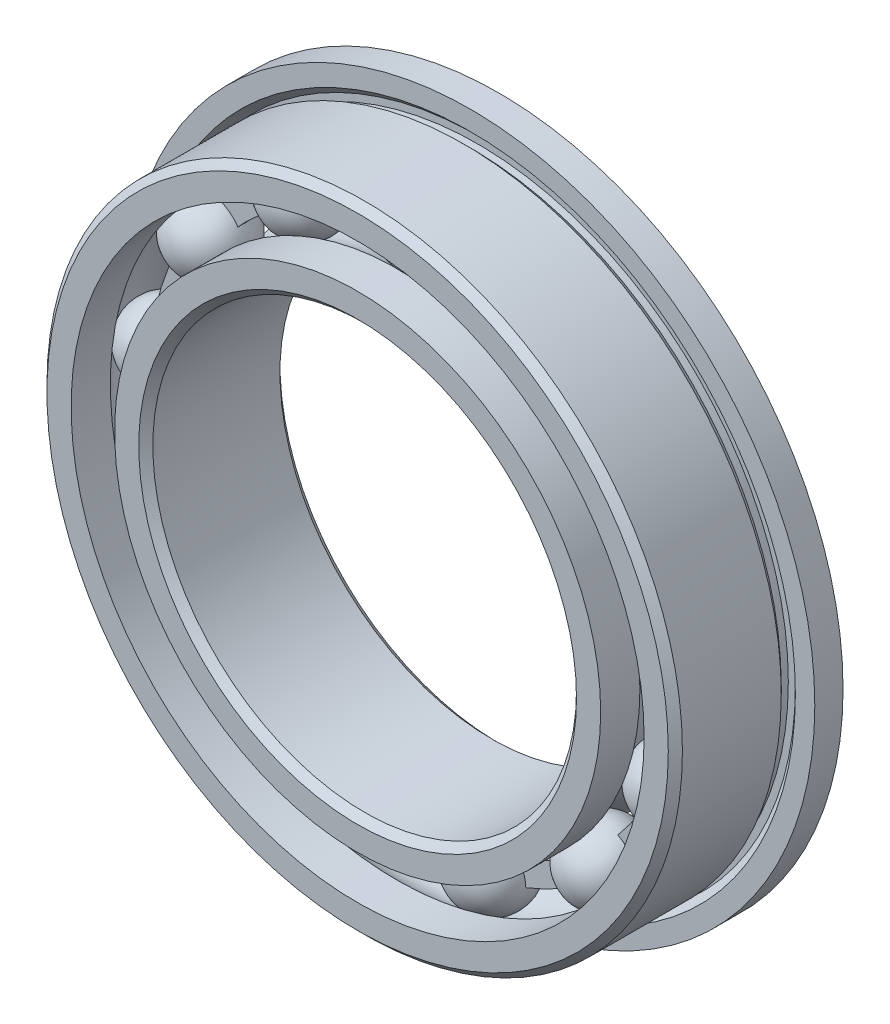
ISO-10303-21;
HEADER;
FILE_DESCRIPTION(('STEP AP214'),'2;1');
FILE_NAME('part.step','',(''),(''),'','','');
FILE_SCHEMA(('AUTOMOTIVE_DESIGN { 1 0 10303 214 1 1 1 1 }'));
ENDSEC;
DATA;
#1=APPLICATION_CONTEXT('core data for automotive mechanical design processes');
#2=APPLICATION_PROTOCOL_DEFINITION('international standard','automotive_design',2000,#1);
#3=PRODUCT_CONTEXT('',#1,'mechanical');
#4=PRODUCT('Part','Part','',(#3));
#5=PRODUCT_RELATED_PRODUCT_CATEGORY('part','',(#4));
#6=PRODUCT_DEFINITION_FORMATION('','',#4);
#7=PRODUCT_DEFINITION_CONTEXT('part definition',#1,'design');
#8=PRODUCT_DEFINITION('design','',#6,#7);
#9=PRODUCT_DEFINITION_SHAPE('','',#8);
#10=(LENGTH_UNIT() NAMED_UNIT(*) SI_UNIT(.MILLI.,.METRE.));
#11=(NAMED_UNIT(*) PLANE_ANGLE_UNIT() SI_UNIT($,.RADIAN.));
#12=(NAMED_UNIT(*) SI_UNIT($,.STERADIAN.) SOLID_ANGLE_UNIT());
#13=UNCERTAINTY_MEASURE_WITH_UNIT(LENGTH_MEASURE(1.E-05),#10,'distance_accuracy_value','');
#14=(GEOMETRIC_REPRESENTATION_CONTEXT(3) GLOBAL_UNCERTAINTY_ASSIGNED_CONTEXT((#13)) GLOBAL_UNIT_ASSIGNED_CONTEXT((#10,
#11,#12)) REPRESENTATION_CONTEXT('',''));
#15=CARTESIAN_POINT('',(0.,0.,0.));
#16=DIRECTION('',(0.,0.,1.));
#17=DIRECTION('',(1.,0.,0.));
#18=AXIS2_PLACEMENT_3D('',#15,#16,#17);
#19=CARTESIAN_POINT('',(-3.48542379032818,6.64092019239912,0.));
#20=DIRECTION('',(0.,0.,1.));
#21=DIRECTION('',(-0.464723172043757,0.885456025653216,0.));
#22=AXIS2_PLACEMENT_3D('',#19,#20,#21);
#23=SPHERICAL_SURFACE('',#22,1.08112056757893);
#24=CARTESIAN_POINT('',(-3.48542379032818,6.64092019239912,1.08112056757893));
#25=VERTEX_POINT('',#24);
#26=VERTEX_LOOP('',#25);
#27=FACE_BOUND('',#26,.T.);
#28=ADVANCED_FACE('F42',(#27),#23,.T.);
#29=CLOSED_SHELL('',(#28));
#30=MANIFOLD_SOLID_BREP('B2',#29);
#31=CARTESIAN_POINT('',(-6.17237899420237,4.26048560048374,0.));
#32=DIRECTION('',(0.,0.,1.));
#33=DIRECTION('',(-0.822983865893649,0.568064746731166,0.));
#34=AXIS2_PLACEMENT_3D('',#31,#32,#33);
#35=SPHERICAL_SURFACE('',#34,1.08112056757893);
#36=CARTESIAN_POINT('',(-6.17237899420237,4.26048560048374,1.08112056757893));
#37=VERTEX_POINT('',#36);
#38=VERTEX_LOOP('',#37);
#39=FACE_BOUND('',#38,.T.);
#40=ADVANCED_FACE('F63',(#39),#35,.T.);
#41=CLOSED_SHELL('',(#40));
#42=MANIFOLD_SOLID_BREP('B6',#41);
#43=CARTESIAN_POINT('',(-7.4453165557354,0.904025101915004,0.));
#44=DIRECTION('',(0.,0.,1.));
#45=DIRECTION('',(-0.992708874098053,0.120536680255334,0.));
#46=AXIS2_PLACEMENT_3D('',#43,#44,#45);
#47=SPHERICAL_SURFACE('',#46,1.08112056757893);
#48=CARTESIAN_POINT('',(-7.4453165557354,0.904025101915004,1.08112056757893));
#49=VERTEX_POINT('',#48);
#50=VERTEX_LOOP('',#49);
#51=FACE_BOUND('',#50,.T.);
#52=ADVANCED_FACE('F84',(#51),#47,.T.);
#53=CLOSED_SHELL('',(#52));
#54=MANIFOLD_SOLID_BREP('B38',#53);
#55=CARTESIAN_POINT('',(-7.01262182014064,-2.65953665281895,0.));
#56=DIRECTION('',(0.,0.,1.));
#57=DIRECTION('',(-0.935016242685418,-0.354604887042527,0.));
#58=AXIS2_PLACEMENT_3D('',#55,#56,#57);
#59=SPHERICAL_SURFACE('',#58,1.08112056757893);
#60=CARTESIAN_POINT('',(-7.01262182014064,-2.65953665281895,1.08112056757893));
#61=VERTEX_POINT('',#60);
#62=VERTEX_LOOP('',#61);
#63=FACE_BOUND('',#62,.T.);
#64=ADVANCED_FACE('F105',(#63),#59,.T.);
#65=CLOSED_SHELL('',(#64));
#66=MANIFOLD_SOLID_BREP('B59',#65);
#67=CARTESIAN_POINT('',(-4.97341993680601,-5.61383061128322,0.));
#68=DIRECTION('',(0.,0.,1.));
#69=DIRECTION('',(-0.663122658240802,-0.748510748171095,0.));
#70=AXIS2_PLACEMENT_3D('',#67,#68,#69);
#71=SPHERICAL_SURFACE('',#70,1.08112056757893);
#72=CARTESIAN_POINT('',(-4.97341993680601,-5.61383061128322,1.08112056757893));
#73=VERTEX_POINT('',#72);
#74=VERTEX_LOOP('',#73);
#75=FACE_BOUND('',#74,.T.);
#76=ADVANCED_FACE('F126',(#75),#71,.T.);
#77=CLOSED_SHELL('',(#76));
#78=MANIFOLD_SOLID_BREP('B80',#77);
#79=CARTESIAN_POINT('',(-1.79486748215674,-7.28206363069538,0.));
#80=DIRECTION('',(0.,0.,1.));
#81=DIRECTION('',(-0.239315664287565,-0.97094181742605,0.));
#82=AXIS2_PLACEMENT_3D('',#79,#80,#81);
#83=SPHERICAL_SURFACE('',#82,1.08112056757893);
#84=CARTESIAN_POINT('',(-1.79486748215674,-7.28206363069538,1.08112056757893));
#85=VERTEX_POINT('',#84);
#86=VERTEX_LOOP('',#85);
#87=FACE_BOUND('',#86,.T.);
#88=ADVANCED_FACE('F147',(#87),#83,.T.);
#89=CLOSED_SHELL('',(#88));
#90=MANIFOLD_SOLID_BREP('B101',#89);
#91=CARTESIAN_POINT('',(1.79486748215664,-7.2820636306954,0.));
#92=DIRECTION('',(0.,0.,1.));
#93=DIRECTION('',(0.239315664287552,-0.970941817426054,0.));
#94=AXIS2_PLACEMENT_3D('',#91,#92,#93);
#95=SPHERICAL_SURFACE('',#94,1.08112056757893);
#96=CARTESIAN_POINT('',(1.79486748215664,-7.2820636306954,1.08112056757893));
#97=VERTEX_POINT('',#96);
#98=VERTEX_LOOP('',#97);
#99=FACE_BOUND('',#98,.T.);
#100=ADVANCED_FACE('F168',(#99),#95,.T.);
#101=CLOSED_SHELL('',(#100));
#102=MANIFOLD_SOLID_BREP('B122',#101);
#103=CARTESIAN_POINT('',(4.97341993680593,-5.61383061128328,0.));
#104=DIRECTION('',(0.,0.,1.));
#105=DIRECTION('',(0.663122658240791,-0.748510748171105,0.));
#106=AXIS2_PLACEMENT_3D('',#103,#104,#105);
#107=SPHERICAL_SURFACE('',#106,1.08112056757893);
#108=CARTESIAN_POINT('',(4.97341993680593,-5.61383061128328,1.08112056757893));
#109=VERTEX_POINT('',#108);
#110=VERTEX_LOOP('',#109);
#111=FACE_BOUND('',#110,.T.);
#112=ADVANCED_FACE('F189',(#111),#107,.T.);
#113=CLOSED_SHELL('',(#112));
#114=MANIFOLD_SOLID_BREP('B143',#113);
#115=CARTESIAN_POINT('',(7.0126218201406,-2.65953665281905,0.));
#116=DIRECTION('',(0.,0.,1.));
#117=DIRECTION('',(0.935016242685413,-0.35460488704254,0.));
#118=AXIS2_PLACEMENT_3D('',#115,#116,#117);
#119=SPHERICAL_SURFACE('',#118,1.08112056757893);
#120=CARTESIAN_POINT('',(7.0126218201406,-2.65953665281905,1.08112056757893));
#121=VERTEX_POINT('',#120);
#122=VERTEX_LOOP('',#121);
#123=FACE_BOUND('',#122,.T.);
#124=ADVANCED_FACE('F210',(#123),#119,.T.);
#125=CLOSED_SHELL('',(#124));
#126=MANIFOLD_SOLID_BREP('B164',#125);
#127=CARTESIAN_POINT('',(7.44531655573541,0.904025101914899,0.));
#128=DIRECTION('',(0.,0.,1.));
#129=DIRECTION('',(0.992708874098054,0.12053668025532,0.));
#130=AXIS2_PLACEMENT_3D('',#127,#128,#129);
#131=SPHERICAL_SURFACE('',#130,1.08112056757893);
#132=CARTESIAN_POINT('',(7.44531655573541,0.904025101914899,1.08112056757893));
#133=VERTEX_POINT('',#132);
#134=VERTEX_LOOP('',#133);
#135=FACE_BOUND('',#134,.T.);
#136=ADVANCED_FACE('F231',(#135),#131,.T.);
#137=CLOSED_SHELL('',(#136));
#138=MANIFOLD_SOLID_BREP('B185',#137);
#139=CARTESIAN_POINT('',(6.17237899420243,4.26048560048366,0.));
#140=DIRECTION('',(0.,0.,1.));
#141=DIRECTION('',(0.822983865893658,0.568064746731154,0.));
#142=AXIS2_PLACEMENT_3D('',#139,#140,#141);
#143=SPHERICAL_SURFACE('',#142,1.08112056757893);
#144=CARTESIAN_POINT('',(6.17237899420243,4.26048560048366,1.08112056757893));
#145=VERTEX_POINT('',#144);
#146=VERTEX_LOOP('',#145);
#147=FACE_BOUND('',#146,.T.);
#148=ADVANCED_FACE('F252',(#147),#143,.T.);
#149=CLOSED_SHELL('',(#148));
#150=MANIFOLD_SOLID_BREP('B206',#149);
#151=CARTESIAN_POINT('',(3.48542379032827,6.64092019239907,0.));
#152=DIRECTION('',(0.,0.,1.));
#153=DIRECTION('',(0.46472317204377,0.885456025653209,0.));
#154=AXIS2_PLACEMENT_3D('',#151,#152,#153);
#155=SPHERICAL_SURFACE('',#154,1.08112056757893);
#156=CARTESIAN_POINT('',(3.48542379032827,6.64092019239907,1.08112056757893));
#157=VERTEX_POINT('',#156);
#158=VERTEX_LOOP('',#157);
#159=FACE_BOUND('',#158,.T.);
#160=ADVANCED_FACE('F273',(#159),#155,.T.);
#161=CLOSED_SHELL('',(#160));
#162=MANIFOLD_SOLID_BREP('B227',#161);
#163=CARTESIAN_POINT('',(0.,7.5,0.));
#164=DIRECTION('',(0.,0.,1.));
#165=DIRECTION('',(0.,1.,0.));
#166=AXIS2_PLACEMENT_3D('',#163,#164,#165);
#167=SPHERICAL_SURFACE('',#166,1.08112056757893);
#168=CARTESIAN_POINT('',(0.,7.5,1.08112056757893));
#169=VERTEX_POINT('',#168);
#170=VERTEX_LOOP('',#169);
#171=FACE_BOUND('',#170,.T.);
#172=ADVANCED_FACE('F296',(#171),#167,.T.);
#173=CLOSED_SHELL('',(#172));
#174=MANIFOLD_SOLID_BREP('B248',#173);
#175=CARTESIAN_POINT('',(0.,7.80769230769231,0.102564102564103));
#176=DIRECTION('',(0.,0.,-1.));
#177=DIRECTION('',(-1.,0.,0.));
#178=AXIS2_PLACEMENT_3D('',#175,#176,#177);
#179=PLANE('',#178);
#180=CARTESIAN_POINT('',(0.,0.,0.102564102564102));
#181=DIRECTION('',(0.,0.,1.));
#182=DIRECTION('',(1.,0.,0.));
#183=AXIS2_PLACEMENT_3D('',#180,#181,#182);
#184=CIRCLE('',#183,7.19230769230769);
#185=CARTESIAN_POINT('',(7.19230769230769,0.,0.102564102564102));
#186=VERTEX_POINT('',#185);
#187=EDGE_CURVE('E295',#186,#186,#184,.T.);
#188=ORIENTED_EDGE('',*,*,#187,.F.);
#189=EDGE_LOOP('',(#188));
#190=FACE_BOUND('',#189,.T.);
#191=CARTESIAN_POINT('',(0.,0.,0.102564102564102));
#192=DIRECTION('',(0.,0.,1.));
#193=DIRECTION('',(1.,0.,0.));
#194=AXIS2_PLACEMENT_3D('',#191,#192,#193);
#195=CIRCLE('',#194,7.80769230769231);
#196=CARTESIAN_POINT('',(7.80769230769231,0.,0.102564102564102));
#197=VERTEX_POINT('',#196);
#198=EDGE_CURVE('E331',#197,#197,#195,.T.);
#199=ORIENTED_EDGE('',*,*,#198,.T.);
#200=EDGE_LOOP('',(#199));
#201=FACE_BOUND('',#200,.T.);
#202=ADVANCED_FACE('F317',(#190,#201),#179,.F.);
#203=CARTESIAN_POINT('',(0.,0.,2.));
#204=DIRECTION('',(0.,0.,1.));
#205=DIRECTION('',(1.,0.,0.));
#206=AXIS2_PLACEMENT_3D('',#203,#204,#205);
#207=CYLINDRICAL_SURFACE('',#206,7.19230769230769);
#208=CARTESIAN_POINT('',(0.,0.,-0.102564102564102));
#209=DIRECTION('',(0.,0.,1.));
#210=DIRECTION('',(1.,0.,0.));
#211=AXIS2_PLACEMENT_3D('',#208,#209,#210);
#212=CIRCLE('',#211,7.19230769230769);
#213=CARTESIAN_POINT('',(7.19230769230769,0.,-0.102564102564102));
#214=VERTEX_POINT('',#213);
#215=EDGE_CURVE('E323',#214,#214,#212,.T.);
#216=ORIENTED_EDGE('',*,*,#215,.F.);
#217=EDGE_LOOP('',(#216));
#218=FACE_BOUND('',#217,.T.);
#219=ORIENTED_EDGE('',*,*,#187,.T.);
#220=EDGE_LOOP('',(#219));
#221=FACE_BOUND('',#220,.T.);
#222=ADVANCED_FACE('F346',(#218,#221),#207,.F.);
#223=CARTESIAN_POINT('',(0.,7.80769230769231,-0.102564102564102));
#224=DIRECTION('',(0.,0.,1.));
#225=DIRECTION('',(1.,0.,0.));
#226=AXIS2_PLACEMENT_3D('',#223,#224,#225);
#227=PLANE('',#226);
#228=CARTESIAN_POINT('',(0.,0.,-0.102564102564102));
#229=DIRECTION('',(0.,0.,1.));
#230=DIRECTION('',(1.,0.,0.));
#231=AXIS2_PLACEMENT_3D('',#228,#229,#230);
#232=CIRCLE('',#231,7.80769230769231);
#233=CARTESIAN_POINT('',(7.80769230769231,0.,-0.102564102564102));
#234=VERTEX_POINT('',#233);
#235=EDGE_CURVE('E327',#234,#234,#232,.T.);
#236=ORIENTED_EDGE('',*,*,#235,.F.);
#237=EDGE_LOOP('',(#236));
#238=FACE_BOUND('',#237,.T.);
#239=ORIENTED_EDGE('',*,*,#215,.T.);
#240=EDGE_LOOP('',(#239));
#241=FACE_BOUND('',#240,.T.);
#242=ADVANCED_FACE('F341',(#238,#241),#227,.F.);
#243=CARTESIAN_POINT('',(0.,0.,2.));
#244=DIRECTION('',(0.,0.,1.));
#245=DIRECTION('',(1.,0.,0.));
#246=AXIS2_PLACEMENT_3D('',#243,#244,#245);
#247=CYLINDRICAL_SURFACE('',#246,7.80769230769231);
#248=ORIENTED_EDGE('',*,*,#198,.F.);
#249=EDGE_LOOP('',(#248));
#250=FACE_BOUND('',#249,.T.);
#251=ORIENTED_EDGE('',*,*,#235,.T.);
#252=EDGE_LOOP('',(#251));
#253=FACE_BOUND('',#252,.T.);
#254=ADVANCED_FACE('F338',(#250,#253),#247,.T.);
#255=CLOSED_SHELL('',(#202,#222,#242,#254));
#256=MANIFOLD_SOLID_BREP('B269',#255);
#257=CARTESIAN_POINT('',(0.,6.88461538461538,2.));
#258=DIRECTION('',(0.,0.,-1.));
#259=DIRECTION('',(-1.,0.,0.));
#260=AXIS2_PLACEMENT_3D('',#257,#258,#259);
#261=PLANE('',#260);
#262=CARTESIAN_POINT('',(0.,0.,2.));
#263=DIRECTION('',(0.,0.,1.));
#264=DIRECTION('',(1.,0.,0.));
#265=AXIS2_PLACEMENT_3D('',#262,#263,#264);
#266=CIRCLE('',#265,6.2);
#267=CARTESIAN_POINT('',(6.2,0.,2.));
#268=VERTEX_POINT('',#267);
#269=EDGE_CURVE('E414',#268,#268,#266,.T.);
#270=ORIENTED_EDGE('',*,*,#269,.F.);
#271=EDGE_LOOP('',(#270));
#272=FACE_BOUND('',#271,.T.);
#273=CARTESIAN_POINT('',(0.,0.,2.));
#274=DIRECTION('',(0.,0.,1.));
#275=DIRECTION('',(1.,0.,0.));
#276=AXIS2_PLACEMENT_3D('',#273,#274,#275);
#277=CIRCLE('',#276,6.88461538461538);
#278=CARTESIAN_POINT('',(6.88461538461538,0.,2.));
#279=VERTEX_POINT('',#278);
#280=EDGE_CURVE('E316',#279,#279,#277,.T.);
#281=ORIENTED_EDGE('',*,*,#280,.T.);
#282=EDGE_LOOP('',(#281));
#283=FACE_BOUND('',#282,.T.);
#284=ADVANCED_FACE('F386',(#272,#283),#261,.F.);
#285=CARTESIAN_POINT('',(0.,0.,2.));
#286=DIRECTION('',(0.,0.,1.));
#287=DIRECTION('',(1.,0.,0.));
#288=AXIS2_PLACEMENT_3D('',#285,#286,#287);
#289=CYLINDRICAL_SURFACE('',#288,6.88461538461538);
#290=ORIENTED_EDGE('',*,*,#280,.F.);
#291=EDGE_LOOP('',(#290));
#292=FACE_BOUND('',#291,.T.);
#293=CARTESIAN_POINT('',(0.,0.,0.888888888888889));
#294=DIRECTION('',(0.,0.,1.));
#295=DIRECTION('',(1.,0.,0.));
#296=AXIS2_PLACEMENT_3D('',#293,#294,#295);
#297=CIRCLE('',#296,6.88461538461538);
#298=CARTESIAN_POINT('',(6.88461538461538,0.,0.888888888888889));
#299=VERTEX_POINT('',#298);
#300=EDGE_CURVE('E392',#299,#299,#297,.T.);
#301=ORIENTED_EDGE('',*,*,#300,.T.);
#302=EDGE_LOOP('',(#301));
#303=FACE_BOUND('',#302,.T.);
#304=ADVANCED_FACE('F421',(#292,#303),#289,.T.);
#305=CARTESIAN_POINT('',(0.,0.,0.));
#306=DIRECTION('',(0.,0.,1.));
#307=DIRECTION('',(1.,0.,0.));
#308=AXIS2_PLACEMENT_3D('',#305,#306,#307);
#309=TOROIDAL_SURFACE('',#308,7.49999999999999,1.08112056757893);
#310=ORIENTED_EDGE('',*,*,#300,.F.);
#311=EDGE_LOOP('',(#310));
#312=FACE_BOUND('',#311,.T.);
#313=CARTESIAN_POINT('',(0.,0.,-0.88888888888889));
#314=DIRECTION('',(0.,0.,1.));
#315=DIRECTION('',(1.,0.,0.));
#316=AXIS2_PLACEMENT_3D('',#313,#314,#315);
#317=CIRCLE('',#316,6.88461538461538);
#318=CARTESIAN_POINT('',(6.88461538461538,0.,-0.88888888888889));
#319=VERTEX_POINT('',#318);
#320=EDGE_CURVE('E396',#319,#319,#317,.T.);
#321=ORIENTED_EDGE('',*,*,#320,.T.);
#322=EDGE_LOOP('',(#321));
#323=FACE_BOUND('',#322,.T.);
#324=ADVANCED_FACE('F425',(#312,#323),#309,.F.);
#325=CARTESIAN_POINT('',(0.,0.,2.));
#326=DIRECTION('',(0.,0.,1.));
#327=DIRECTION('',(1.,0.,0.));
#328=AXIS2_PLACEMENT_3D('',#325,#326,#327);
#329=CYLINDRICAL_SURFACE('',#328,6.88461538461538);
#330=ORIENTED_EDGE('',*,*,#320,.F.);
#331=EDGE_LOOP('',(#330));
#332=FACE_BOUND('',#331,.T.);
#333=CARTESIAN_POINT('',(0.,0.,-2.));
#334=DIRECTION('',(0.,0.,1.));
#335=DIRECTION('',(1.,0.,0.));
#336=AXIS2_PLACEMENT_3D('',#333,#334,#335);
#337=CIRCLE('',#336,6.88461538461538);
#338=CARTESIAN_POINT('',(6.88461538461538,0.,-2.));
#339=VERTEX_POINT('',#338);
#340=EDGE_CURVE('E400',#339,#339,#337,.T.);
#341=ORIENTED_EDGE('',*,*,#340,.T.);
#342=EDGE_LOOP('',(#341));
#343=FACE_BOUND('',#342,.T.);
#344=ADVANCED_FACE('F430',(#332,#343),#329,.T.);
#345=CARTESIAN_POINT('',(0.,6.20000000000001,-2.));
#346=DIRECTION('',(0.,0.,1.));
#347=DIRECTION('',(1.,0.,0.));
#348=AXIS2_PLACEMENT_3D('',#345,#346,#347);
#349=PLANE('',#348);
#350=ORIENTED_EDGE('',*,*,#340,.F.);
#351=EDGE_LOOP('',(#350));
#352=FACE_BOUND('',#351,.T.);
#353=CARTESIAN_POINT('',(0.,0.,-2.));
#354=DIRECTION('',(0.,0.,1.));
#355=DIRECTION('',(1.,0.,0.));
#356=AXIS2_PLACEMENT_3D('',#353,#354,#355);
#357=CIRCLE('',#356,6.20000000000001);
#358=CARTESIAN_POINT('',(6.20000000000001,0.,-2.));
#359=VERTEX_POINT('',#358);
#360=EDGE_CURVE('E405',#359,#359,#357,.T.);
#361=ORIENTED_EDGE('',*,*,#360,.T.);
#362=EDGE_LOOP('',(#361));
#363=FACE_BOUND('',#362,.T.);
#364=ADVANCED_FACE('F436',(#352,#363),#349,.F.);
#365=CARTESIAN_POINT('',(0.,0.,-1.8));
#366=DIRECTION('',(0.,0.,-1.));
#367=DIRECTION('',(-1.,0.,0.));
#368=AXIS2_PLACEMENT_3D('',#365,#366,#367);
#369=CONICAL_SURFACE('',#368,6.,0.785398163397463);
#370=ORIENTED_EDGE('',*,*,#360,.F.);
#371=EDGE_LOOP('',(#370));
#372=FACE_BOUND('',#371,.T.);
#373=CARTESIAN_POINT('',(0.,0.,-1.8));
#374=DIRECTION('',(0.,0.,1.));
#375=DIRECTION('',(1.,0.,0.));
#376=AXIS2_PLACEMENT_3D('',#373,#374,#375);
#377=CIRCLE('',#376,6.);
#378=CARTESIAN_POINT('',(6.,0.,-1.8));
#379=VERTEX_POINT('',#378);
#380=EDGE_CURVE('E408',#379,#379,#377,.T.);
#381=ORIENTED_EDGE('',*,*,#380,.T.);
#382=EDGE_LOOP('',(#381));
#383=FACE_BOUND('',#382,.T.);
#384=ADVANCED_FACE('F440',(#372,#383),#369,.F.);
#385=CARTESIAN_POINT('',(0.,0.,2.));
#386=DIRECTION('',(0.,0.,1.));
#387=DIRECTION('',(1.,0.,0.));
#388=AXIS2_PLACEMENT_3D('',#385,#386,#387);
#389=CYLINDRICAL_SURFACE('',#388,6.);
#390=ORIENTED_EDGE('',*,*,#380,.F.);
#391=EDGE_LOOP('',(#390));
#392=FACE_BOUND('',#391,.T.);
#393=CARTESIAN_POINT('',(0.,0.,1.79999999999999));
#394=DIRECTION('',(0.,0.,1.));
#395=DIRECTION('',(1.,0.,0.));
#396=AXIS2_PLACEMENT_3D('',#393,#394,#395);
#397=CIRCLE('',#396,6.);
#398=CARTESIAN_POINT('',(6.,0.,1.79999999999999));
#399=VERTEX_POINT('',#398);
#400=EDGE_CURVE('E411',#399,#399,#397,.T.);
#401=ORIENTED_EDGE('',*,*,#400,.T.);
#402=EDGE_LOOP('',(#401));
#403=FACE_BOUND('',#402,.T.);
#404=ADVANCED_FACE('F444',(#392,#403),#389,.F.);
#405=CARTESIAN_POINT('',(0.,0.,2.));
#406=DIRECTION('',(0.,0.,1.));
#407=DIRECTION('',(1.,0.,0.));
#408=AXIS2_PLACEMENT_3D('',#405,#406,#407);
#409=CONICAL_SURFACE('',#408,6.2,0.785398163397433);
#410=ORIENTED_EDGE('',*,*,#400,.F.);
#411=EDGE_LOOP('',(#410));
#412=FACE_BOUND('',#411,.T.);
#413=ORIENTED_EDGE('',*,*,#269,.T.);
#414=EDGE_LOOP('',(#413));
#415=FACE_BOUND('',#414,.T.);
#416=ADVANCED_FACE('F418',(#412,#415),#409,.F.);
#417=CLOSED_SHELL('',(#284,#304,#324,#344,#364,#384,#404,#416));
#418=MANIFOLD_SOLID_BREP('B290',#417);
#419=CARTESIAN_POINT('',(0.,0.,2.));
#420=DIRECTION('',(0.,0.,1.));
#421=DIRECTION('',(1.,0.,0.));
#422=AXIS2_PLACEMENT_3D('',#419,#420,#421);
#423=CYLINDRICAL_SURFACE('',#422,9.);
#424=CARTESIAN_POINT('',(0.,0.,1.8));
#425=DIRECTION('',(0.,0.,1.));
#426=DIRECTION('',(1.,0.,0.));
#427=AXIS2_PLACEMENT_3D('',#424,#425,#426);
#428=CIRCLE('',#427,9.);
#429=CARTESIAN_POINT('',(9.,0.,1.8));
#430=VERTEX_POINT('',#429);
#431=EDGE_CURVE('E551',#430,#430,#428,.T.);
#432=ORIENTED_EDGE('',*,*,#431,.F.);
#433=EDGE_LOOP('',(#432));
#434=FACE_BOUND('',#433,.T.);
#435=CARTESIAN_POINT('',(0.,0.,-0.999999999999998));
#436=DIRECTION('',(0.,0.,1.));
#437=DIRECTION('',(1.,0.,0.));
#438=AXIS2_PLACEMENT_3D('',#435,#436,#437);
#439=CIRCLE('',#438,9.);
#440=CARTESIAN_POINT('',(9.,0.,-0.999999999999998));
#441=VERTEX_POINT('',#440);
#442=EDGE_CURVE('E385',#441,#441,#439,.T.);
#443=ORIENTED_EDGE('',*,*,#442,.T.);
#444=EDGE_LOOP('',(#443));
#445=FACE_BOUND('',#444,.T.);
#446=ADVANCED_FACE('F508',(#434,#445),#423,.T.);
#447=CARTESIAN_POINT('',(0.,0.,-1.2));
#448=DIRECTION('',(0.,0.,1.));
#449=DIRECTION('',(1.,0.,0.));
#450=AXIS2_PLACEMENT_3D('',#447,#448,#449);
#451=CONICAL_SURFACE('',#450,8.8,0.785398163397437);
#452=ORIENTED_EDGE('',*,*,#442,.F.);
#453=EDGE_LOOP('',(#452));
#454=FACE_BOUND('',#453,.T.);
#455=CARTESIAN_POINT('',(0.,0.,-1.2));
#456=DIRECTION('',(0.,0.,1.));
#457=DIRECTION('',(1.,0.,0.));
#458=AXIS2_PLACEMENT_3D('',#455,#456,#457);
#459=CIRCLE('',#458,8.8);
#460=CARTESIAN_POINT('',(8.8,0.,-1.2));
#461=VERTEX_POINT('',#460);
#462=EDGE_CURVE('E514',#461,#461,#459,.T.);
#463=ORIENTED_EDGE('',*,*,#462,.T.);
#464=EDGE_LOOP('',(#463));
#465=FACE_BOUND('',#464,.T.);
#466=ADVANCED_FACE('F558',(#454,#465),#451,.T.);
#467=CARTESIAN_POINT('',(0.,0.,2.));
#468=DIRECTION('',(0.,0.,1.));
#469=DIRECTION('',(1.,0.,0.));
#470=AXIS2_PLACEMENT_3D('',#467,#468,#469);
#471=CYLINDRICAL_SURFACE('',#470,8.8);
#472=ORIENTED_EDGE('',*,*,#462,.F.);
#473=EDGE_LOOP('',(#472));
#474=FACE_BOUND('',#473,.T.);
#475=CARTESIAN_POINT('',(0.,0.,-1.4));
#476=DIRECTION('',(0.,0.,1.));
#477=DIRECTION('',(1.,0.,0.));
#478=AXIS2_PLACEMENT_3D('',#475,#476,#477);
#479=CIRCLE('',#478,8.8);
#480=CARTESIAN_POINT('',(8.8,0.,-1.4));
#481=VERTEX_POINT('',#480);
#482=EDGE_CURVE('E518',#481,#481,#479,.T.);
#483=ORIENTED_EDGE('',*,*,#482,.T.);
#484=EDGE_LOOP('',(#483));
#485=FACE_BOUND('',#484,.T.);
#486=ADVANCED_FACE('F562',(#474,#485),#471,.T.);
#487=CARTESIAN_POINT('',(0.,9.,-1.4));
#488=DIRECTION('',(0.,0.,-1.));
#489=DIRECTION('',(-1.,0.,0.));
#490=AXIS2_PLACEMENT_3D('',#487,#488,#489);
#491=PLANE('',#490);
#492=ORIENTED_EDGE('',*,*,#482,.F.);
#493=EDGE_LOOP('',(#492));
#494=FACE_BOUND('',#493,.T.);
#495=CARTESIAN_POINT('',(0.,0.,-1.4));
#496=DIRECTION('',(0.,0.,1.));
#497=DIRECTION('',(1.,0.,0.));
#498=AXIS2_PLACEMENT_3D('',#495,#496,#497);
#499=CIRCLE('',#498,9.);
#500=CARTESIAN_POINT('',(9.,0.,-1.4));
#501=VERTEX_POINT('',#500);
#502=EDGE_CURVE('E522',#501,#501,#499,.T.);
#503=ORIENTED_EDGE('',*,*,#502,.T.);
#504=EDGE_LOOP('',(#503));
#505=FACE_BOUND('',#504,.T.);
#506=ADVANCED_FACE('F567',(#494,#505),#491,.F.);
#507=CARTESIAN_POINT('',(0.,0.,-1.2));
#508=DIRECTION('',(0.,0.,1.));
#509=DIRECTION('',(1.,0.,0.));
#510=AXIS2_PLACEMENT_3D('',#507,#508,#509);
#511=CONICAL_SURFACE('',#510,9.2,0.785398163397445);
#512=ORIENTED_EDGE('',*,*,#502,.F.);
#513=EDGE_LOOP('',(#512));
#514=FACE_BOUND('',#513,.T.);
#515=CARTESIAN_POINT('',(0.,0.,-1.2));
#516=DIRECTION('',(0.,0.,1.));
#517=DIRECTION('',(1.,0.,0.));
#518=AXIS2_PLACEMENT_3D('',#515,#516,#517);
#519=CIRCLE('',#518,9.2);
#520=CARTESIAN_POINT('',(9.2,0.,-1.2));
#521=VERTEX_POINT('',#520);
#522=EDGE_CURVE('E527',#521,#521,#519,.T.);
#523=ORIENTED_EDGE('',*,*,#522,.T.);
#524=EDGE_LOOP('',(#523));
#525=FACE_BOUND('',#524,.T.);
#526=ADVANCED_FACE('F573',(#514,#525),#511,.F.);
#527=CARTESIAN_POINT('',(0.,9.75,-1.2));
#528=DIRECTION('',(0.,0.,-1.));
#529=DIRECTION('',(-1.,0.,0.));
#530=AXIS2_PLACEMENT_3D('',#527,#528,#529);
#531=PLANE('',#530);
#532=ORIENTED_EDGE('',*,*,#522,.F.);
#533=EDGE_LOOP('',(#532));
#534=FACE_BOUND('',#533,.T.);
#535=CARTESIAN_POINT('',(0.,0.,-1.2));
#536=DIRECTION('',(0.,0.,1.));
#537=DIRECTION('',(1.,0.,0.));
#538=AXIS2_PLACEMENT_3D('',#535,#536,#537);
#539=CIRCLE('',#538,9.75);
#540=CARTESIAN_POINT('',(9.75,0.,-1.2));
#541=VERTEX_POINT('',#540);
#542=EDGE_CURVE('E530',#541,#541,#539,.T.);
#543=ORIENTED_EDGE('',*,*,#542,.T.);
#544=EDGE_LOOP('',(#543));
#545=FACE_BOUND('',#544,.T.);
#546=ADVANCED_FACE('F577',(#534,#545),#531,.F.);
#547=CARTESIAN_POINT('',(0.,0.,2.));
#548=DIRECTION('',(0.,0.,1.));
#549=DIRECTION('',(1.,0.,0.));
#550=AXIS2_PLACEMENT_3D('',#547,#548,#549);
#551=CYLINDRICAL_SURFACE('',#550,9.75);
#552=ORIENTED_EDGE('',*,*,#542,.F.);
#553=EDGE_LOOP('',(#552));
#554=FACE_BOUND('',#553,.T.);
#555=CARTESIAN_POINT('',(0.,0.,-2.));
#556=DIRECTION('',(0.,0.,1.));
#557=DIRECTION('',(1.,0.,0.));
#558=AXIS2_PLACEMENT_3D('',#555,#556,#557);
#559=CIRCLE('',#558,9.75);
#560=CARTESIAN_POINT('',(9.75,0.,-2.));
#561=VERTEX_POINT('',#560);
#562=EDGE_CURVE('E533',#561,#561,#559,.T.);
#563=ORIENTED_EDGE('',*,*,#562,.T.);
#564=EDGE_LOOP('',(#563));
#565=FACE_BOUND('',#564,.T.);
#566=ADVANCED_FACE('F581',(#554,#565),#551,.T.);
#567=CARTESIAN_POINT('',(0.,8.8,-2.));
#568=DIRECTION('',(0.,0.,1.));
#569=DIRECTION('',(1.,0.,0.));
#570=AXIS2_PLACEMENT_3D('',#567,#568,#569);
#571=PLANE('',#570);
#572=ORIENTED_EDGE('',*,*,#562,.F.);
#573=EDGE_LOOP('',(#572));
#574=FACE_BOUND('',#573,.T.);
#575=CARTESIAN_POINT('',(0.,0.,-2.));
#576=DIRECTION('',(0.,0.,1.));
#577=DIRECTION('',(1.,0.,0.));
#578=AXIS2_PLACEMENT_3D('',#575,#576,#577);
#579=CIRCLE('',#578,8.11538461538461);
#580=CARTESIAN_POINT('',(8.11538461538461,0.,-2.));
#581=VERTEX_POINT('',#580);
#582=EDGE_CURVE('E536',#581,#581,#579,.T.);
#583=ORIENTED_EDGE('',*,*,#582,.T.);
#584=EDGE_LOOP('',(#583));
#585=FACE_BOUND('',#584,.T.);
#586=ADVANCED_FACE('F585',(#574,#585),#571,.F.);
#587=CARTESIAN_POINT('',(0.,0.,2.));
#588=DIRECTION('',(0.,0.,1.));
#589=DIRECTION('',(1.,0.,0.));
#590=AXIS2_PLACEMENT_3D('',#587,#588,#589);
#591=CYLINDRICAL_SURFACE('',#590,8.11538461538461);
#592=ORIENTED_EDGE('',*,*,#582,.F.);
#593=EDGE_LOOP('',(#592));
#594=FACE_BOUND('',#593,.T.);
#595=CARTESIAN_POINT('',(0.,0.,-0.888888888888889));
#596=DIRECTION('',(0.,0.,1.));
#597=DIRECTION('',(1.,0.,0.));
#598=AXIS2_PLACEMENT_3D('',#595,#596,#597);
#599=CIRCLE('',#598,8.11538461538461);
#600=CARTESIAN_POINT('',(8.11538461538461,0.,-0.888888888888889));
#601=VERTEX_POINT('',#600);
#602=EDGE_CURVE('E539',#601,#601,#599,.T.);
#603=ORIENTED_EDGE('',*,*,#602,.T.);
#604=EDGE_LOOP('',(#603));
#605=FACE_BOUND('',#604,.T.);
#606=ADVANCED_FACE('F589',(#594,#605),#591,.F.);
#607=CARTESIAN_POINT('',(0.,0.,0.));
#608=DIRECTION('',(0.,0.,1.));
#609=DIRECTION('',(1.,0.,0.));
#610=AXIS2_PLACEMENT_3D('',#607,#608,#609);
#611=TOROIDAL_SURFACE('',#610,7.5,1.08112056757893);
#612=ORIENTED_EDGE('',*,*,#602,.F.);
#613=EDGE_LOOP('',(#612));
#614=FACE_BOUND('',#613,.T.);
#615=CARTESIAN_POINT('',(0.,0.,0.888888888888889));
#616=DIRECTION('',(0.,0.,1.));
#617=DIRECTION('',(1.,0.,0.));
#618=AXIS2_PLACEMENT_3D('',#615,#616,#617);
#619=CIRCLE('',#618,8.11538461538461);
#620=CARTESIAN_POINT('',(8.11538461538461,0.,0.888888888888889));
#621=VERTEX_POINT('',#620);
#622=EDGE_CURVE('E542',#621,#621,#619,.T.);
#623=ORIENTED_EDGE('',*,*,#622,.T.);
#624=EDGE_LOOP('',(#623));
#625=FACE_BOUND('',#624,.T.);
#626=ADVANCED_FACE('F593',(#614,#625),#611,.F.);
#627=CARTESIAN_POINT('',(0.,0.,2.));
#628=DIRECTION('',(0.,0.,1.));
#629=DIRECTION('',(1.,0.,0.));
#630=AXIS2_PLACEMENT_3D('',#627,#628,#629);
#631=CYLINDRICAL_SURFACE('',#630,8.11538461538461);
#632=ORIENTED_EDGE('',*,*,#622,.F.);
#633=EDGE_LOOP('',(#632));
#634=FACE_BOUND('',#633,.T.);
#635=CARTESIAN_POINT('',(0.,0.,2.));
#636=DIRECTION('',(0.,0.,1.));
#637=DIRECTION('',(1.,0.,0.));
#638=AXIS2_PLACEMENT_3D('',#635,#636,#637);
#639=CIRCLE('',#638,8.11538461538461);
#640=CARTESIAN_POINT('',(8.11538461538461,0.,2.));
#641=VERTEX_POINT('',#640);
#642=EDGE_CURVE('E545',#641,#641,#639,.T.);
#643=ORIENTED_EDGE('',*,*,#642,.T.);
#644=EDGE_LOOP('',(#643));
#645=FACE_BOUND('',#644,.T.);
#646=ADVANCED_FACE('F597',(#634,#645),#631,.F.);
#647=CARTESIAN_POINT('',(0.,8.8,2.));
#648=DIRECTION('',(0.,0.,-1.));
#649=DIRECTION('',(-1.,0.,0.));
#650=AXIS2_PLACEMENT_3D('',#647,#648,#649);
#651=PLANE('',#650);
#652=ORIENTED_EDGE('',*,*,#642,.F.);
#653=EDGE_LOOP('',(#652));
#654=FACE_BOUND('',#653,.T.);
#655=CARTESIAN_POINT('',(0.,0.,2.));
#656=DIRECTION('',(0.,0.,1.));
#657=DIRECTION('',(1.,0.,0.));
#658=AXIS2_PLACEMENT_3D('',#655,#656,#657);
#659=CIRCLE('',#658,8.8);
#660=CARTESIAN_POINT('',(8.8,0.,2.));
#661=VERTEX_POINT('',#660);
#662=EDGE_CURVE('E548',#661,#661,#659,.T.);
#663=ORIENTED_EDGE('',*,*,#662,.T.);
#664=EDGE_LOOP('',(#663));
#665=FACE_BOUND('',#664,.T.);
#666=ADVANCED_FACE('F601',(#654,#665),#651,.F.);
#667=CARTESIAN_POINT('',(0.,0.,1.8));
#668=DIRECTION('',(0.,0.,-1.));
#669=DIRECTION('',(-1.,0.,0.));
#670=AXIS2_PLACEMENT_3D('',#667,#668,#669);
#671=CONICAL_SURFACE('',#670,9.,0.785398163397458);
#672=ORIENTED_EDGE('',*,*,#662,.F.);
#673=EDGE_LOOP('',(#672));
#674=FACE_BOUND('',#673,.T.);
#675=ORIENTED_EDGE('',*,*,#431,.T.);
#676=EDGE_LOOP('',(#675));
#677=FACE_BOUND('',#676,.T.);
#678=ADVANCED_FACE('F555',(#674,#677),#671,.T.);
#679=CLOSED_SHELL('',(#446,#466,#486,#506,#526,#546,#566,#586,#606,#626,#646,#666,#678));
#680=MANIFOLD_SOLID_BREP('B311',#679);
#681=ADVANCED_BREP_SHAPE_REPRESENTATION('',(#18,#30,#42,#54,#66,#78,#90,#102,#114,#126,#138,
#150,#162,#174,#256,#418,#680),#14);
#682=SHAPE_DEFINITION_REPRESENTATION(#9,#681);
ENDSEC;
END-ISO-10303-21;
